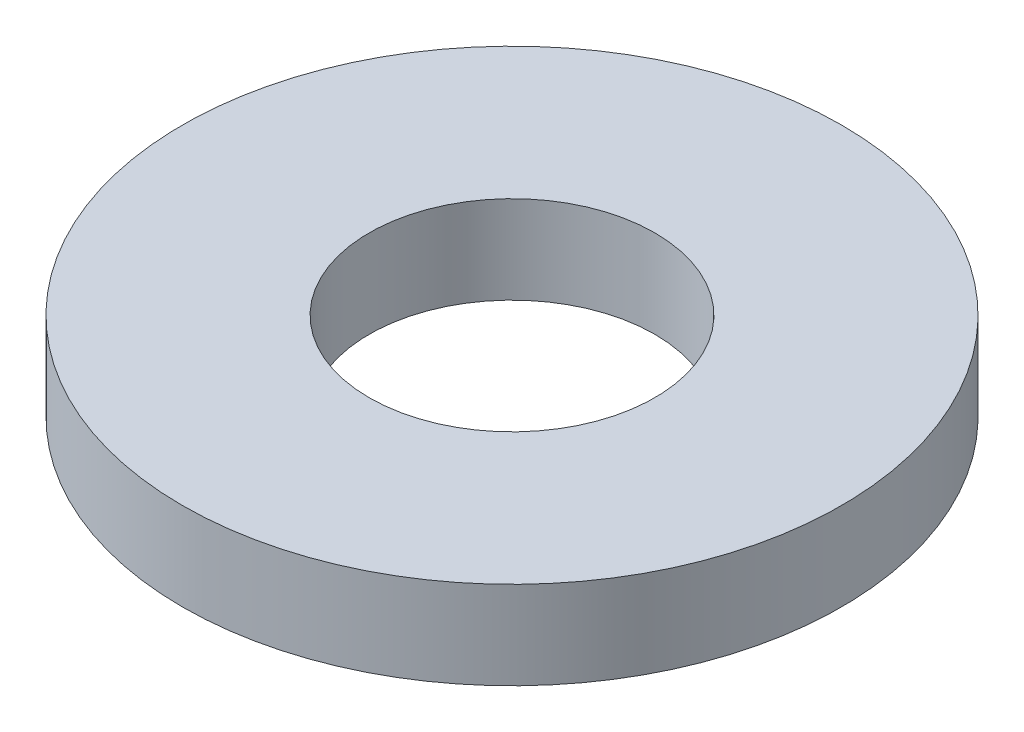
ISO-10303-21;
HEADER;
FILE_DESCRIPTION(('STEP AP214'),'2;1');
FILE_NAME('part.step','',(''),(''),'','','');
FILE_SCHEMA(('AUTOMOTIVE_DESIGN { 1 0 10303 214 1 1 1 1 }'));
ENDSEC;
DATA;
#1=APPLICATION_CONTEXT('core data for automotive mechanical design processes');
#2=APPLICATION_PROTOCOL_DEFINITION('international standard','automotive_design',2000,#1);
#3=PRODUCT_CONTEXT('',#1,'mechanical');
#4=PRODUCT('Part','Part','',(#3));
#5=PRODUCT_RELATED_PRODUCT_CATEGORY('part','',(#4));
#6=PRODUCT_DEFINITION_FORMATION('','',#4);
#7=PRODUCT_DEFINITION_CONTEXT('part definition',#1,'design');
#8=PRODUCT_DEFINITION('design','',#6,#7);
#9=PRODUCT_DEFINITION_SHAPE('','',#8);
#10=(LENGTH_UNIT() NAMED_UNIT(*) SI_UNIT(.MILLI.,.METRE.));
#11=(NAMED_UNIT(*) PLANE_ANGLE_UNIT() SI_UNIT($,.RADIAN.));
#12=(NAMED_UNIT(*) SI_UNIT($,.STERADIAN.) SOLID_ANGLE_UNIT());
#13=UNCERTAINTY_MEASURE_WITH_UNIT(LENGTH_MEASURE(1.E-05),#10,'distance_accuracy_value','');
#14=(GEOMETRIC_REPRESENTATION_CONTEXT(3) GLOBAL_UNCERTAINTY_ASSIGNED_CONTEXT((#13)) GLOBAL_UNIT_ASSIGNED_CONTEXT((#10,
#11,#12)) REPRESENTATION_CONTEXT('',''));
#15=CARTESIAN_POINT('',(0.,0.,0.));
#16=DIRECTION('',(0.,0.,1.));
#17=DIRECTION('',(1.,0.,0.));
#18=AXIS2_PLACEMENT_3D('',#15,#16,#17);
#19=CARTESIAN_POINT('',(0.,20.,0.));
#20=DIRECTION('',(0.,-1.,0.));
#21=DIRECTION('',(0.,0.,-1.));
#22=AXIS2_PLACEMENT_3D('',#19,#20,#21);
#23=CYLINDRICAL_SURFACE('',#22,75.);
#24=CARTESIAN_POINT('',(0.,20.,0.));
#25=DIRECTION('',(0.,1.,0.));
#26=DIRECTION('',(0.,0.,1.));
#27=AXIS2_PLACEMENT_3D('',#24,#25,#26);
#28=CIRCLE('',#27,75.);
#29=CARTESIAN_POINT('',(0.,20.,75.));
#30=VERTEX_POINT('',#29);
#31=EDGE_CURVE('E10',#30,#30,#28,.T.);
#32=ORIENTED_EDGE('',*,*,#31,.F.);
#33=EDGE_LOOP('',(#32));
#34=FACE_BOUND('',#33,.T.);
#35=CARTESIAN_POINT('',(0.,0.,0.));
#36=DIRECTION('',(0.,1.,0.));
#37=DIRECTION('',(0.,0.,1.));
#38=AXIS2_PLACEMENT_3D('',#35,#36,#37);
#39=CIRCLE('',#38,75.);
#40=CARTESIAN_POINT('',(0.,0.,75.));
#41=VERTEX_POINT('',#40);
#42=EDGE_CURVE('E37',#41,#41,#39,.T.);
#43=ORIENTED_EDGE('',*,*,#42,.T.);
#44=EDGE_LOOP('',(#43));
#45=FACE_BOUND('',#44,.T.);
#46=ADVANCED_FACE('F40',(#34,#45),#23,.T.);
#47=CARTESIAN_POINT('',(0.,20.,0.));
#48=DIRECTION('',(0.,1.,0.));
#49=DIRECTION('',(0.,0.,1.));
#50=AXIS2_PLACEMENT_3D('',#47,#48,#49);
#51=PLANE('',#50);
#52=CARTESIAN_POINT('',(0.,20.,0.));
#53=DIRECTION('',(0.,1.,0.));
#54=DIRECTION('',(0.,0.,1.));
#55=AXIS2_PLACEMENT_3D('',#52,#53,#54);
#56=CIRCLE('',#55,32.5);
#57=CARTESIAN_POINT('',(0.,20.,32.5));
#58=VERTEX_POINT('',#57);
#59=EDGE_CURVE('E50',#58,#58,#56,.T.);
#60=ORIENTED_EDGE('',*,*,#59,.F.);
#61=EDGE_LOOP('',(#60));
#62=FACE_BOUND('',#61,.T.);
#63=ORIENTED_EDGE('',*,*,#31,.T.);
#64=EDGE_LOOP('',(#63));
#65=FACE_BOUND('',#64,.T.);
#66=ADVANCED_FACE('F59',(#62,#65),#51,.T.);
#67=CARTESIAN_POINT('',(0.,0.,0.));
#68=DIRECTION('',(0.,1.,0.));
#69=DIRECTION('',(0.,0.,1.));
#70=AXIS2_PLACEMENT_3D('',#67,#68,#69);
#71=PLANE('',#70);
#72=CARTESIAN_POINT('',(0.,0.,0.));
#73=DIRECTION('',(0.,1.,0.));
#74=DIRECTION('',(0.,0.,1.));
#75=AXIS2_PLACEMENT_3D('',#72,#73,#74);
#76=CIRCLE('',#75,32.5);
#77=CARTESIAN_POINT('',(0.,0.,32.5));
#78=VERTEX_POINT('',#77);
#79=EDGE_CURVE('E47',#78,#78,#76,.T.);
#80=ORIENTED_EDGE('',*,*,#79,.T.);
#81=EDGE_LOOP('',(#80));
#82=FACE_BOUND('',#81,.T.);
#83=ORIENTED_EDGE('',*,*,#42,.F.);
#84=EDGE_LOOP('',(#83));
#85=FACE_BOUND('',#84,.T.);
#86=ADVANCED_FACE('F58',(#82,#85),#71,.F.);
#87=CARTESIAN_POINT('',(0.,20.,0.));
#88=DIRECTION('',(0.,-1.,0.));
#89=DIRECTION('',(0.,0.,-1.));
#90=AXIS2_PLACEMENT_3D('',#87,#88,#89);
#91=CYLINDRICAL_SURFACE('',#90,32.5);
#92=ORIENTED_EDGE('',*,*,#59,.T.);
#93=EDGE_LOOP('',(#92));
#94=FACE_BOUND('',#93,.T.);
#95=ORIENTED_EDGE('',*,*,#79,.F.);
#96=EDGE_LOOP('',(#95));
#97=FACE_BOUND('',#96,.T.);
#98=ADVANCED_FACE('F54',(#94,#97),#91,.F.);
#99=CLOSED_SHELL('',(#46,#66,#86,#98));
#100=MANIFOLD_SOLID_BREP('B2',#99);
#101=ADVANCED_BREP_SHAPE_REPRESENTATION('',(#18,#100),#14);
#102=SHAPE_DEFINITION_REPRESENTATION(#9,#101);
ENDSEC;
END-ISO-10303-21;
